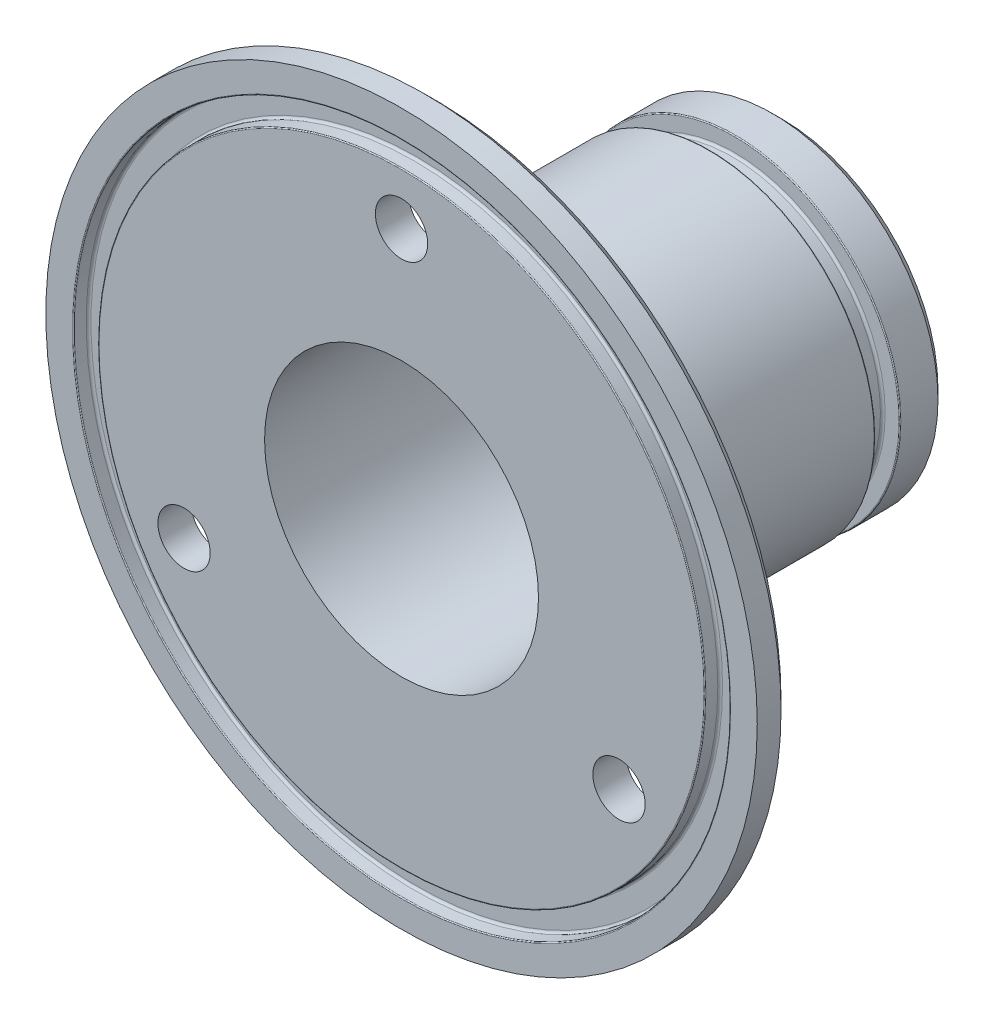
ISO-10303-21;
HEADER;
FILE_DESCRIPTION(('STEP AP214'),'2;1');
FILE_NAME('part.step','',(''),(''),'','','');
FILE_SCHEMA(('AUTOMOTIVE_DESIGN { 1 0 10303 214 1 1 1 1 }'));
ENDSEC;
DATA;
#1=APPLICATION_CONTEXT('core data for automotive mechanical design processes');
#2=APPLICATION_PROTOCOL_DEFINITION('international standard','automotive_design',2000,#1);
#3=PRODUCT_CONTEXT('',#1,'mechanical');
#4=PRODUCT('Part','Part','',(#3));
#5=PRODUCT_RELATED_PRODUCT_CATEGORY('part','',(#4));
#6=PRODUCT_DEFINITION_FORMATION('','',#4);
#7=PRODUCT_DEFINITION_CONTEXT('part definition',#1,'design');
#8=PRODUCT_DEFINITION('design','',#6,#7);
#9=PRODUCT_DEFINITION_SHAPE('','',#8);
#10=(LENGTH_UNIT() NAMED_UNIT(*) SI_UNIT(.MILLI.,.METRE.));
#11=(NAMED_UNIT(*) PLANE_ANGLE_UNIT() SI_UNIT($,.RADIAN.));
#12=(NAMED_UNIT(*) SI_UNIT($,.STERADIAN.) SOLID_ANGLE_UNIT());
#13=UNCERTAINTY_MEASURE_WITH_UNIT(LENGTH_MEASURE(1.E-05),#10,'distance_accuracy_value','');
#14=(GEOMETRIC_REPRESENTATION_CONTEXT(3) GLOBAL_UNCERTAINTY_ASSIGNED_CONTEXT((#13)) GLOBAL_UNIT_ASSIGNED_CONTEXT((#10,
#11,#12)) REPRESENTATION_CONTEXT('',''));
#15=CARTESIAN_POINT('',(0.,0.,0.));
#16=DIRECTION('',(0.,0.,1.));
#17=DIRECTION('',(1.,0.,0.));
#18=AXIS2_PLACEMENT_3D('',#15,#16,#17);
#19=CARTESIAN_POINT('',(0.,0.,40.));
#20=DIRECTION('',(0.,0.,1.));
#21=DIRECTION('',(1.,0.,0.));
#22=AXIS2_PLACEMENT_3D('',#19,#20,#21);
#23=PLANE('',#22);
#24=CARTESIAN_POINT('',(0.,0.,40.));
#25=DIRECTION('',(0.,0.,1.));
#26=DIRECTION('',(1.,0.,0.));
#27=AXIS2_PLACEMENT_3D('',#24,#25,#26);
#28=CIRCLE('',#27,31.8);
#29=CARTESIAN_POINT('',(31.8,0.,40.));
#30=VERTEX_POINT('',#29);
#31=EDGE_CURVE('E91',#30,#30,#28,.T.);
#32=ORIENTED_EDGE('',*,*,#31,.T.);
#33=EDGE_LOOP('',(#32));
#34=FACE_BOUND('',#33,.T.);
#35=CARTESIAN_POINT('',(0.,26.4,40.));
#36=DIRECTION('',(0.,0.,-1.));
#37=DIRECTION('',(-1.,0.,0.));
#38=AXIS2_PLACEMENT_3D('',#35,#36,#37);
#39=CIRCLE('',#38,2.75);
#40=CARTESIAN_POINT('',(-2.75,26.4,40.));
#41=VERTEX_POINT('',#40);
#42=EDGE_CURVE('E152',#41,#41,#39,.T.);
#43=ORIENTED_EDGE('',*,*,#42,.T.);
#44=EDGE_LOOP('',(#43));
#45=FACE_BOUND('',#44,.T.);
#46=CARTESIAN_POINT('',(22.8630706599093,-13.1999999999998,40.));
#47=DIRECTION('',(0.,0.,-1.));
#48=DIRECTION('',(0.499999999999992,0.866025403784443,0.));
#49=AXIS2_PLACEMENT_3D('',#46,#47,#48);
#50=CIRCLE('',#49,2.75);
#51=CARTESIAN_POINT('',(24.2380706599093,-10.8184301395926,40.));
#52=VERTEX_POINT('',#51);
#53=EDGE_CURVE('E166',#52,#52,#50,.T.);
#54=ORIENTED_EDGE('',*,*,#53,.T.);
#55=EDGE_LOOP('',(#54));
#56=FACE_BOUND('',#55,.T.);
#57=CARTESIAN_POINT('',(-22.8630706599091,-13.2000000000001,40.));
#58=DIRECTION('',(0.,0.,-1.));
#59=DIRECTION('',(0.500000000000004,-0.866025403784436,0.));
#60=AXIS2_PLACEMENT_3D('',#57,#58,#59);
#61=CIRCLE('',#60,2.75);
#62=CARTESIAN_POINT('',(-21.4880706599091,-15.5815698604073,40.));
#63=VERTEX_POINT('',#62);
#64=EDGE_CURVE('E165',#63,#63,#61,.T.);
#65=ORIENTED_EDGE('',*,*,#64,.T.);
#66=EDGE_LOOP('',(#65));
#67=FACE_BOUND('',#66,.T.);
#68=CARTESIAN_POINT('',(0.,0.,40.));
#69=DIRECTION('',(0.,0.,1.));
#70=DIRECTION('',(1.,0.,0.));
#71=AXIS2_PLACEMENT_3D('',#68,#69,#70);
#72=CIRCLE('',#71,14.4);
#73=CARTESIAN_POINT('',(14.4,0.,40.));
#74=VERTEX_POINT('',#73);
#75=EDGE_CURVE('E140',#74,#74,#72,.T.);
#76=ORIENTED_EDGE('',*,*,#75,.F.);
#77=EDGE_LOOP('',(#76));
#78=FACE_BOUND('',#77,.T.);
#79=ADVANCED_FACE('F42',(#34,#45,#56,#67,#78),#23,.T.);
#80=CARTESIAN_POINT('',(0.,0.,40.));
#81=DIRECTION('',(0.,0.,-1.));
#82=DIRECTION('',(-1.,0.,0.));
#83=AXIS2_PLACEMENT_3D('',#80,#81,#82);
#84=CYLINDRICAL_SURFACE('',#83,17.4);
#85=CARTESIAN_POINT('',(0.,0.,35.5));
#86=DIRECTION('',(0.,0.,1.));
#87=DIRECTION('',(1.,0.,0.));
#88=AXIS2_PLACEMENT_3D('',#85,#86,#87);
#89=CIRCLE('',#88,17.4);
#90=CARTESIAN_POINT('',(17.4,0.,35.5));
#91=VERTEX_POINT('',#90);
#92=EDGE_CURVE('E58',#91,#91,#89,.F.);
#93=ORIENTED_EDGE('',*,*,#92,.T.);
#94=EDGE_LOOP('',(#93));
#95=FACE_BOUND('',#94,.T.);
#96=CARTESIAN_POINT('',(0.,0.,7.7));
#97=DIRECTION('',(0.,0.,-1.));
#98=DIRECTION('',(-1.,0.,0.));
#99=AXIS2_PLACEMENT_3D('',#96,#97,#98);
#100=CIRCLE('',#99,17.4);
#101=CARTESIAN_POINT('',(-17.4,0.,7.7));
#102=VERTEX_POINT('',#101);
#103=EDGE_CURVE('E130',#102,#102,#100,.F.);
#104=ORIENTED_EDGE('',*,*,#103,.T.);
#105=EDGE_LOOP('',(#104));
#106=FACE_BOUND('',#105,.T.);
#107=ADVANCED_FACE('F207',(#95,#106),#84,.T.);
#108=CARTESIAN_POINT('',(0.,0.,1.00000000000002));
#109=DIRECTION('',(0.,0.,1.));
#110=DIRECTION('',(1.,0.,0.));
#111=AXIS2_PLACEMENT_3D('',#108,#109,#110);
#112=CIRCLE('',#111,17.4);
#113=CARTESIAN_POINT('',(17.4,0.,1.00000000000002));
#114=VERTEX_POINT('',#113);
#115=EDGE_CURVE('E51',#114,#114,#112,.T.);
#116=ORIENTED_EDGE('',*,*,#115,.T.);
#117=EDGE_LOOP('',(#116));
#118=FACE_BOUND('',#117,.T.);
#119=CARTESIAN_POINT('',(0.,0.,4.9));
#120=DIRECTION('',(0.,0.,1.));
#121=DIRECTION('',(1.,0.,0.));
#122=AXIS2_PLACEMENT_3D('',#119,#120,#121);
#123=CIRCLE('',#122,17.4);
#124=CARTESIAN_POINT('',(17.4,0.,4.9));
#125=VERTEX_POINT('',#124);
#126=EDGE_CURVE('E134',#125,#125,#123,.F.);
#127=ORIENTED_EDGE('',*,*,#126,.T.);
#128=EDGE_LOOP('',(#127));
#129=FACE_BOUND('',#128,.T.);
#130=ADVANCED_FACE('F215',(#118,#129),#84,.T.);
#131=CARTESIAN_POINT('',(0.,0.,40.));
#132=DIRECTION('',(0.,0.,1.));
#133=DIRECTION('',(1.,0.,0.));
#134=AXIS2_PLACEMENT_3D('',#131,#132,#133);
#135=CIRCLE('',#134,34.6);
#136=CARTESIAN_POINT('',(34.6,0.,40.));
#137=VERTEX_POINT('',#136);
#138=EDGE_CURVE('E79',#137,#137,#135,.F.);
#139=ORIENTED_EDGE('',*,*,#138,.T.);
#140=EDGE_LOOP('',(#139));
#141=FACE_BOUND('',#140,.T.);
#142=CARTESIAN_POINT('',(0.,0.,40.));
#143=DIRECTION('',(0.,0.,1.));
#144=DIRECTION('',(1.,0.,0.));
#145=AXIS2_PLACEMENT_3D('',#142,#143,#144);
#146=CIRCLE('',#145,37.4);
#147=CARTESIAN_POINT('',(37.4,0.,40.));
#148=VERTEX_POINT('',#147);
#149=EDGE_CURVE('E145',#148,#148,#146,.T.);
#150=ORIENTED_EDGE('',*,*,#149,.T.);
#151=EDGE_LOOP('',(#150));
#152=FACE_BOUND('',#151,.T.);
#153=ADVANCED_FACE('F210',(#141,#152),#23,.T.);
#154=CARTESIAN_POINT('',(0.,0.,0.));
#155=DIRECTION('',(0.,0.,1.));
#156=DIRECTION('',(1.,0.,0.));
#157=AXIS2_PLACEMENT_3D('',#154,#155,#156);
#158=PLANE('',#157);
#159=CARTESIAN_POINT('',(0.,0.,0.));
#160=DIRECTION('',(0.,0.,1.));
#161=DIRECTION('',(1.,0.,0.));
#162=AXIS2_PLACEMENT_3D('',#159,#160,#161);
#163=CIRCLE('',#162,16.4);
#164=CARTESIAN_POINT('',(16.4,0.,0.));
#165=VERTEX_POINT('',#164);
#166=EDGE_CURVE('E10',#165,#165,#163,.F.);
#167=ORIENTED_EDGE('',*,*,#166,.T.);
#168=EDGE_LOOP('',(#167));
#169=FACE_BOUND('',#168,.T.);
#170=CARTESIAN_POINT('',(0.,0.,0.));
#171=DIRECTION('',(0.,0.,1.));
#172=DIRECTION('',(1.,0.,0.));
#173=AXIS2_PLACEMENT_3D('',#170,#171,#172);
#174=CIRCLE('',#173,14.4);
#175=CARTESIAN_POINT('',(14.4,0.,0.));
#176=VERTEX_POINT('',#175);
#177=EDGE_CURVE('E141',#176,#176,#174,.T.);
#178=ORIENTED_EDGE('',*,*,#177,.T.);
#179=EDGE_LOOP('',(#178));
#180=FACE_BOUND('',#179,.T.);
#181=ADVANCED_FACE('F222',(#169,#180),#158,.F.);
#182=CARTESIAN_POINT('',(0.,0.,40.));
#183=DIRECTION('',(0.,0.,-1.));
#184=DIRECTION('',(-1.,0.,0.));
#185=AXIS2_PLACEMENT_3D('',#182,#183,#184);
#186=CYLINDRICAL_SURFACE('',#185,14.4);
#187=ORIENTED_EDGE('',*,*,#75,.T.);
#188=EDGE_LOOP('',(#187));
#189=FACE_BOUND('',#188,.T.);
#190=ORIENTED_EDGE('',*,*,#177,.F.);
#191=EDGE_LOOP('',(#190));
#192=FACE_BOUND('',#191,.T.);
#193=ADVANCED_FACE('F228',(#189,#192),#186,.F.);
#194=CARTESIAN_POINT('',(-17.4,0.,5.));
#195=DIRECTION('',(0.,0.,1.));
#196=DIRECTION('',(1.,0.,0.));
#197=AXIS2_PLACEMENT_3D('',#194,#195,#196);
#198=PLANE('',#197);
#199=CARTESIAN_POINT('',(0.,0.,5.));
#200=DIRECTION('',(0.,0.,1.));
#201=DIRECTION('',(1.,0.,0.));
#202=AXIS2_PLACEMENT_3D('',#199,#200,#201);
#203=CIRCLE('',#202,15.85);
#204=CARTESIAN_POINT('',(15.85,0.,5.));
#205=VERTEX_POINT('',#204);
#206=EDGE_CURVE('E115',#205,#205,#203,.F.);
#207=ORIENTED_EDGE('',*,*,#206,.T.);
#208=EDGE_LOOP('',(#207));
#209=FACE_BOUND('',#208,.T.);
#210=CARTESIAN_POINT('',(0.,0.,5.));
#211=DIRECTION('',(0.,0.,1.));
#212=DIRECTION('',(1.,0.,0.));
#213=AXIS2_PLACEMENT_3D('',#210,#211,#212);
#214=CIRCLE('',#213,17.3);
#215=CARTESIAN_POINT('',(17.3,0.,5.));
#216=VERTEX_POINT('',#215);
#217=EDGE_CURVE('E137',#216,#216,#214,.T.);
#218=ORIENTED_EDGE('',*,*,#217,.T.);
#219=EDGE_LOOP('',(#218));
#220=FACE_BOUND('',#219,.T.);
#221=ADVANCED_FACE('F252',(#209,#220),#198,.T.);
#222=CARTESIAN_POINT('',(0.,0.,40.));
#223=DIRECTION('',(0.,0.,1.));
#224=DIRECTION('',(1.,0.,0.));
#225=AXIS2_PLACEMENT_3D('',#222,#223,#224);
#226=CYLINDRICAL_SURFACE('',#225,15.6);
#227=CARTESIAN_POINT('',(0.,0.,5.25));
#228=DIRECTION('',(0.,0.,1.));
#229=DIRECTION('',(1.,0.,0.));
#230=AXIS2_PLACEMENT_3D('',#227,#228,#229);
#231=CIRCLE('',#230,15.6);
#232=CARTESIAN_POINT('',(15.6,0.,5.25));
#233=VERTEX_POINT('',#232);
#234=EDGE_CURVE('E118',#233,#233,#231,.T.);
#235=ORIENTED_EDGE('',*,*,#234,.T.);
#236=EDGE_LOOP('',(#235));
#237=FACE_BOUND('',#236,.T.);
#238=CARTESIAN_POINT('',(0.,0.,7.35));
#239=DIRECTION('',(0.,0.,-1.));
#240=DIRECTION('',(-1.,0.,0.));
#241=AXIS2_PLACEMENT_3D('',#238,#239,#240);
#242=CIRCLE('',#241,15.6);
#243=CARTESIAN_POINT('',(-15.6,0.,7.35));
#244=VERTEX_POINT('',#243);
#245=EDGE_CURVE('E122',#244,#244,#242,.T.);
#246=ORIENTED_EDGE('',*,*,#245,.T.);
#247=EDGE_LOOP('',(#246));
#248=FACE_BOUND('',#247,.T.);
#249=ADVANCED_FACE('F248',(#237,#248),#226,.T.);
#250=CARTESIAN_POINT('',(-15.6,0.,7.6));
#251=DIRECTION('',(0.,0.,-1.));
#252=DIRECTION('',(-1.,0.,0.));
#253=AXIS2_PLACEMENT_3D('',#250,#251,#252);
#254=PLANE('',#253);
#255=CARTESIAN_POINT('',(0.,0.,7.6));
#256=DIRECTION('',(0.,0.,-1.));
#257=DIRECTION('',(-1.,0.,0.));
#258=AXIS2_PLACEMENT_3D('',#255,#256,#257);
#259=CIRCLE('',#258,15.85);
#260=CARTESIAN_POINT('',(-15.85,0.,7.6));
#261=VERTEX_POINT('',#260);
#262=EDGE_CURVE('E111',#261,#261,#259,.F.);
#263=ORIENTED_EDGE('',*,*,#262,.T.);
#264=EDGE_LOOP('',(#263));
#265=FACE_BOUND('',#264,.T.);
#266=CARTESIAN_POINT('',(0.,0.,7.6));
#267=DIRECTION('',(0.,0.,-1.));
#268=DIRECTION('',(-1.,0.,0.));
#269=AXIS2_PLACEMENT_3D('',#266,#267,#268);
#270=CIRCLE('',#269,17.3);
#271=CARTESIAN_POINT('',(-17.3,0.,7.6));
#272=VERTEX_POINT('',#271);
#273=EDGE_CURVE('E126',#272,#272,#270,.T.);
#274=ORIENTED_EDGE('',*,*,#273,.T.);
#275=EDGE_LOOP('',(#274));
#276=FACE_BOUND('',#275,.T.);
#277=ADVANCED_FACE('F244',(#265,#276),#254,.T.);
#278=CARTESIAN_POINT('',(0.,0.,4.9));
#279=DIRECTION('',(0.,0.,1.));
#280=DIRECTION('',(1.,0.,0.));
#281=AXIS2_PLACEMENT_3D('',#278,#279,#280);
#282=TOROIDAL_SURFACE('',#281,17.3,0.1);
#283=ORIENTED_EDGE('',*,*,#126,.F.);
#284=EDGE_LOOP('',(#283));
#285=FACE_BOUND('',#284,.T.);
#286=ORIENTED_EDGE('',*,*,#217,.F.);
#287=EDGE_LOOP('',(#286));
#288=FACE_BOUND('',#287,.T.);
#289=ADVANCED_FACE('F247',(#285,#288),#282,.T.);
#290=CARTESIAN_POINT('',(0.,0.,7.7));
#291=DIRECTION('',(0.,0.,-1.));
#292=DIRECTION('',(-1.,0.,0.));
#293=AXIS2_PLACEMENT_3D('',#290,#291,#292);
#294=TOROIDAL_SURFACE('',#293,17.3,0.1);
#295=ORIENTED_EDGE('',*,*,#273,.F.);
#296=EDGE_LOOP('',(#295));
#297=FACE_BOUND('',#296,.T.);
#298=ORIENTED_EDGE('',*,*,#103,.F.);
#299=EDGE_LOOP('',(#298));
#300=FACE_BOUND('',#299,.T.);
#301=ADVANCED_FACE('F431',(#297,#300),#294,.T.);
#302=CARTESIAN_POINT('',(0.,0.,5.25));
#303=DIRECTION('',(0.,0.,1.));
#304=DIRECTION('',(1.,0.,0.));
#305=AXIS2_PLACEMENT_3D('',#302,#303,#304);
#306=TOROIDAL_SURFACE('',#305,15.85,0.25);
#307=ORIENTED_EDGE('',*,*,#206,.F.);
#308=EDGE_LOOP('',(#307));
#309=FACE_BOUND('',#308,.T.);
#310=ORIENTED_EDGE('',*,*,#234,.F.);
#311=EDGE_LOOP('',(#310));
#312=FACE_BOUND('',#311,.T.);
#313=ADVANCED_FACE('F240',(#309,#312),#306,.F.);
#314=CARTESIAN_POINT('',(0.,0.,7.35));
#315=DIRECTION('',(0.,0.,-1.));
#316=DIRECTION('',(-1.,0.,0.));
#317=AXIS2_PLACEMENT_3D('',#314,#315,#316);
#318=TOROIDAL_SURFACE('',#317,15.85,0.25);
#319=ORIENTED_EDGE('',*,*,#245,.F.);
#320=EDGE_LOOP('',(#319));
#321=FACE_BOUND('',#320,.T.);
#322=ORIENTED_EDGE('',*,*,#262,.F.);
#323=EDGE_LOOP('',(#322));
#324=FACE_BOUND('',#323,.T.);
#325=ADVANCED_FACE('F234',(#321,#324),#318,.F.);
#326=CARTESIAN_POINT('',(0.,0.,36.5));
#327=DIRECTION('',(0.,0.,1.));
#328=DIRECTION('',(1.,0.,0.));
#329=AXIS2_PLACEMENT_3D('',#326,#327,#328);
#330=CYLINDRICAL_SURFACE('',#329,37.4);
#331=CARTESIAN_POINT('',(0.,0.,37.5));
#332=DIRECTION('',(0.,0.,1.));
#333=DIRECTION('',(1.,0.,0.));
#334=AXIS2_PLACEMENT_3D('',#331,#332,#333);
#335=CIRCLE('',#334,37.4);
#336=CARTESIAN_POINT('',(37.4,0.,37.5));
#337=VERTEX_POINT('',#336);
#338=EDGE_CURVE('E75',#337,#337,#335,.T.);
#339=ORIENTED_EDGE('',*,*,#338,.T.);
#340=EDGE_LOOP('',(#339));
#341=FACE_BOUND('',#340,.T.);
#342=ORIENTED_EDGE('',*,*,#149,.F.);
#343=EDGE_LOOP('',(#342));
#344=FACE_BOUND('',#343,.T.);
#345=ADVANCED_FACE('F190',(#341,#344),#330,.T.);
#346=CARTESIAN_POINT('',(0.,0.,36.5));
#347=DIRECTION('',(0.,0.,1.));
#348=DIRECTION('',(1.,0.,0.));
#349=AXIS2_PLACEMENT_3D('',#346,#347,#348);
#350=PLANE('',#349);
#351=CARTESIAN_POINT('',(0.,0.,36.5));
#352=DIRECTION('',(0.,0.,1.));
#353=DIRECTION('',(1.,0.,0.));
#354=AXIS2_PLACEMENT_3D('',#351,#352,#353);
#355=CIRCLE('',#354,18.4);
#356=CARTESIAN_POINT('',(18.4,0.,36.5));
#357=VERTEX_POINT('',#356);
#358=EDGE_CURVE('E65',#357,#357,#355,.T.);
#359=ORIENTED_EDGE('',*,*,#358,.T.);
#360=EDGE_LOOP('',(#359));
#361=FACE_BOUND('',#360,.T.);
#362=CARTESIAN_POINT('',(0.,0.,36.5));
#363=DIRECTION('',(0.,0.,1.));
#364=DIRECTION('',(1.,0.,0.));
#365=AXIS2_PLACEMENT_3D('',#362,#363,#364);
#366=CIRCLE('',#365,36.4);
#367=CARTESIAN_POINT('',(36.4,0.,36.5));
#368=VERTEX_POINT('',#367);
#369=EDGE_CURVE('E71',#368,#368,#366,.F.);
#370=ORIENTED_EDGE('',*,*,#369,.T.);
#371=EDGE_LOOP('',(#370));
#372=FACE_BOUND('',#371,.T.);
#373=CARTESIAN_POINT('',(-22.8630706599091,-13.2000000000001,36.5));
#374=DIRECTION('',(0.,0.,-1.));
#375=DIRECTION('',(0.500000000000004,-0.866025403784436,0.));
#376=AXIS2_PLACEMENT_3D('',#373,#374,#375);
#377=CIRCLE('',#376,2.74999999999999);
#378=CARTESIAN_POINT('',(-21.4880706599091,-15.5815698604073,36.5));
#379=VERTEX_POINT('',#378);
#380=EDGE_CURVE('E160',#379,#379,#377,.T.);
#381=ORIENTED_EDGE('',*,*,#380,.F.);
#382=EDGE_LOOP('',(#381));
#383=FACE_BOUND('',#382,.T.);
#384=CARTESIAN_POINT('',(22.8630706599093,-13.1999999999998,36.5));
#385=DIRECTION('',(0.,0.,-1.));
#386=DIRECTION('',(0.499999999999992,0.866025403784443,0.));
#387=AXIS2_PLACEMENT_3D('',#384,#385,#386);
#388=CIRCLE('',#387,2.74999999999999);
#389=CARTESIAN_POINT('',(24.2380706599093,-10.8184301395926,36.5));
#390=VERTEX_POINT('',#389);
#391=EDGE_CURVE('E161',#390,#390,#388,.T.);
#392=ORIENTED_EDGE('',*,*,#391,.F.);
#393=EDGE_LOOP('',(#392));
#394=FACE_BOUND('',#393,.T.);
#395=CARTESIAN_POINT('',(0.,26.4,36.5));
#396=DIRECTION('',(0.,0.,-1.));
#397=DIRECTION('',(-1.,0.,0.));
#398=AXIS2_PLACEMENT_3D('',#395,#396,#397);
#399=CIRCLE('',#398,2.74999999999999);
#400=CARTESIAN_POINT('',(-2.74999999999999,26.4,36.5));
#401=VERTEX_POINT('',#400);
#402=EDGE_CURVE('E156',#401,#401,#399,.T.);
#403=ORIENTED_EDGE('',*,*,#402,.F.);
#404=EDGE_LOOP('',(#403));
#405=FACE_BOUND('',#404,.T.);
#406=ADVANCED_FACE('F186',(#361,#372,#383,#394,#405),#350,.F.);
#407=CARTESIAN_POINT('',(0.,26.4,36.5));
#408=DIRECTION('',(0.,0.,-1.));
#409=DIRECTION('',(-1.,0.,0.));
#410=AXIS2_PLACEMENT_3D('',#407,#408,#409);
#411=CYLINDRICAL_SURFACE('',#410,2.74999999999999);
#412=ORIENTED_EDGE('',*,*,#42,.F.);
#413=EDGE_LOOP('',(#412));
#414=FACE_BOUND('',#413,.T.);
#415=ORIENTED_EDGE('',*,*,#402,.T.);
#416=EDGE_LOOP('',(#415));
#417=FACE_BOUND('',#416,.T.);
#418=ADVANCED_FACE('F189',(#414,#417),#411,.F.);
#419=CARTESIAN_POINT('',(22.8630706599093,-13.1999999999998,36.5));
#420=DIRECTION('',(0.,0.,-1.));
#421=DIRECTION('',(0.499999999999992,0.866025403784443,0.));
#422=AXIS2_PLACEMENT_3D('',#419,#420,#421);
#423=CYLINDRICAL_SURFACE('',#422,2.74999999999999);
#424=ORIENTED_EDGE('',*,*,#53,.F.);
#425=EDGE_LOOP('',(#424));
#426=FACE_BOUND('',#425,.T.);
#427=ORIENTED_EDGE('',*,*,#391,.T.);
#428=EDGE_LOOP('',(#427));
#429=FACE_BOUND('',#428,.T.);
#430=ADVANCED_FACE('F182',(#426,#429),#423,.F.);
#431=CARTESIAN_POINT('',(-22.8630706599091,-13.2000000000001,36.5));
#432=DIRECTION('',(0.,0.,-1.));
#433=DIRECTION('',(0.500000000000004,-0.866025403784436,0.));
#434=AXIS2_PLACEMENT_3D('',#431,#432,#433);
#435=CYLINDRICAL_SURFACE('',#434,2.74999999999999);
#436=ORIENTED_EDGE('',*,*,#64,.F.);
#437=EDGE_LOOP('',(#436));
#438=FACE_BOUND('',#437,.T.);
#439=ORIENTED_EDGE('',*,*,#380,.T.);
#440=EDGE_LOOP('',(#439));
#441=FACE_BOUND('',#440,.T.);
#442=ADVANCED_FACE('F178',(#438,#441),#435,.F.);
#443=CARTESIAN_POINT('',(0.,0.,38.4));
#444=DIRECTION('',(0.,0.,1.));
#445=DIRECTION('',(1.,0.,0.));
#446=AXIS2_PLACEMENT_3D('',#443,#444,#445);
#447=CYLINDRICAL_SURFACE('',#446,34.5);
#448=CARTESIAN_POINT('',(0.,0.,39.9));
#449=DIRECTION('',(0.,0.,1.));
#450=DIRECTION('',(1.,0.,0.));
#451=AXIS2_PLACEMENT_3D('',#448,#449,#450);
#452=CIRCLE('',#451,34.5);
#453=CARTESIAN_POINT('',(34.5,0.,39.9));
#454=VERTEX_POINT('',#453);
#455=EDGE_CURVE('E83',#454,#454,#452,.T.);
#456=ORIENTED_EDGE('',*,*,#455,.T.);
#457=EDGE_LOOP('',(#456));
#458=FACE_BOUND('',#457,.T.);
#459=CARTESIAN_POINT('',(0.,0.,38.65));
#460=DIRECTION('',(0.,0.,1.));
#461=DIRECTION('',(1.,0.,0.));
#462=AXIS2_PLACEMENT_3D('',#459,#460,#461);
#463=CIRCLE('',#462,34.5);
#464=CARTESIAN_POINT('',(34.5,0.,38.65));
#465=VERTEX_POINT('',#464);
#466=EDGE_CURVE('E95',#465,#465,#463,.F.);
#467=ORIENTED_EDGE('',*,*,#466,.T.);
#468=EDGE_LOOP('',(#467));
#469=FACE_BOUND('',#468,.T.);
#470=ADVANCED_FACE('F181',(#458,#469),#447,.F.);
#471=CARTESIAN_POINT('',(0.,0.,38.4));
#472=DIRECTION('',(0.,0.,1.));
#473=DIRECTION('',(1.,0.,0.));
#474=AXIS2_PLACEMENT_3D('',#471,#472,#473);
#475=PLANE('',#474);
#476=CARTESIAN_POINT('',(0.,0.,38.4));
#477=DIRECTION('',(0.,0.,1.));
#478=DIRECTION('',(1.,0.,0.));
#479=AXIS2_PLACEMENT_3D('',#476,#477,#478);
#480=CIRCLE('',#479,32.15);
#481=CARTESIAN_POINT('',(32.15,0.,38.4));
#482=VERTEX_POINT('',#481);
#483=EDGE_CURVE('E99',#482,#482,#480,.F.);
#484=ORIENTED_EDGE('',*,*,#483,.T.);
#485=EDGE_LOOP('',(#484));
#486=FACE_BOUND('',#485,.T.);
#487=CARTESIAN_POINT('',(0.,0.,38.4));
#488=DIRECTION('',(0.,0.,1.));
#489=DIRECTION('',(1.,0.,0.));
#490=AXIS2_PLACEMENT_3D('',#487,#488,#489);
#491=CIRCLE('',#490,34.25);
#492=CARTESIAN_POINT('',(34.25,0.,38.4));
#493=VERTEX_POINT('',#492);
#494=EDGE_CURVE('E103',#493,#493,#491,.T.);
#495=ORIENTED_EDGE('',*,*,#494,.T.);
#496=EDGE_LOOP('',(#495));
#497=FACE_BOUND('',#496,.T.);
#498=ADVANCED_FACE('F347',(#486,#497),#475,.T.);
#499=CARTESIAN_POINT('',(0.,0.,38.4));
#500=DIRECTION('',(0.,0.,1.));
#501=DIRECTION('',(1.,0.,0.));
#502=AXIS2_PLACEMENT_3D('',#499,#500,#501);
#503=CYLINDRICAL_SURFACE('',#502,31.9);
#504=CARTESIAN_POINT('',(0.,0.,39.9));
#505=DIRECTION('',(0.,0.,1.));
#506=DIRECTION('',(1.,0.,0.));
#507=AXIS2_PLACEMENT_3D('',#504,#505,#506);
#508=CIRCLE('',#507,31.9);
#509=CARTESIAN_POINT('',(31.9,0.,39.9));
#510=VERTEX_POINT('',#509);
#511=EDGE_CURVE('E87',#510,#510,#508,.F.);
#512=ORIENTED_EDGE('',*,*,#511,.T.);
#513=EDGE_LOOP('',(#512));
#514=FACE_BOUND('',#513,.T.);
#515=CARTESIAN_POINT('',(0.,0.,38.65));
#516=DIRECTION('',(0.,0.,1.));
#517=DIRECTION('',(1.,0.,0.));
#518=AXIS2_PLACEMENT_3D('',#515,#516,#517);
#519=CIRCLE('',#518,31.9);
#520=CARTESIAN_POINT('',(31.9,0.,38.65));
#521=VERTEX_POINT('',#520);
#522=EDGE_CURVE('E107',#521,#521,#519,.T.);
#523=ORIENTED_EDGE('',*,*,#522,.T.);
#524=EDGE_LOOP('',(#523));
#525=FACE_BOUND('',#524,.T.);
#526=ADVANCED_FACE('F339',(#514,#525),#503,.T.);
#527=CARTESIAN_POINT('',(0.,0.,38.65));
#528=DIRECTION('',(0.,0.,1.));
#529=DIRECTION('',(1.,0.,0.));
#530=AXIS2_PLACEMENT_3D('',#527,#528,#529);
#531=TOROIDAL_SURFACE('',#530,32.15,0.25);
#532=ORIENTED_EDGE('',*,*,#483,.F.);
#533=EDGE_LOOP('',(#532));
#534=FACE_BOUND('',#533,.T.);
#535=ORIENTED_EDGE('',*,*,#522,.F.);
#536=EDGE_LOOP('',(#535));
#537=FACE_BOUND('',#536,.T.);
#538=ADVANCED_FACE('F331',(#534,#537),#531,.F.);
#539=CARTESIAN_POINT('',(0.,0.,38.65));
#540=DIRECTION('',(0.,0.,1.));
#541=DIRECTION('',(1.,0.,0.));
#542=AXIS2_PLACEMENT_3D('',#539,#540,#541);
#543=TOROIDAL_SURFACE('',#542,34.25,0.25);
#544=ORIENTED_EDGE('',*,*,#466,.F.);
#545=EDGE_LOOP('',(#544));
#546=FACE_BOUND('',#545,.T.);
#547=ORIENTED_EDGE('',*,*,#494,.F.);
#548=EDGE_LOOP('',(#547));
#549=FACE_BOUND('',#548,.T.);
#550=ADVANCED_FACE('F322',(#546,#549),#543,.F.);
#551=CARTESIAN_POINT('',(0.,0.,39.9));
#552=DIRECTION('',(0.,0.,1.));
#553=DIRECTION('',(1.,0.,0.));
#554=AXIS2_PLACEMENT_3D('',#551,#552,#553);
#555=TOROIDAL_SURFACE('',#554,31.8,0.1);
#556=ORIENTED_EDGE('',*,*,#511,.F.);
#557=EDGE_LOOP('',(#556));
#558=FACE_BOUND('',#557,.T.);
#559=ORIENTED_EDGE('',*,*,#31,.F.);
#560=EDGE_LOOP('',(#559));
#561=FACE_BOUND('',#560,.T.);
#562=ADVANCED_FACE('F314',(#558,#561),#555,.T.);
#563=CARTESIAN_POINT('',(0.,0.,39.9));
#564=DIRECTION('',(0.,0.,1.));
#565=DIRECTION('',(1.,0.,0.));
#566=AXIS2_PLACEMENT_3D('',#563,#564,#565);
#567=TOROIDAL_SURFACE('',#566,34.6,0.1);
#568=ORIENTED_EDGE('',*,*,#138,.F.);
#569=EDGE_LOOP('',(#568));
#570=FACE_BOUND('',#569,.T.);
#571=ORIENTED_EDGE('',*,*,#455,.F.);
#572=EDGE_LOOP('',(#571));
#573=FACE_BOUND('',#572,.T.);
#574=ADVANCED_FACE('F306',(#570,#573),#567,.T.);
#575=CARTESIAN_POINT('',(0.,0.,37.5));
#576=DIRECTION('',(0.,0.,1.));
#577=DIRECTION('',(1.,0.,0.));
#578=AXIS2_PLACEMENT_3D('',#575,#576,#577);
#579=CONICAL_SURFACE('',#578,37.4,0.785398163397452);
#580=ORIENTED_EDGE('',*,*,#369,.F.);
#581=EDGE_LOOP('',(#580));
#582=FACE_BOUND('',#581,.T.);
#583=ORIENTED_EDGE('',*,*,#338,.F.);
#584=EDGE_LOOP('',(#583));
#585=FACE_BOUND('',#584,.T.);
#586=ADVANCED_FACE('F302',(#582,#585),#579,.T.);
#587=CARTESIAN_POINT('',(0.,0.,35.5));
#588=DIRECTION('',(0.,0.,1.));
#589=DIRECTION('',(1.,0.,0.));
#590=AXIS2_PLACEMENT_3D('',#587,#588,#589);
#591=TOROIDAL_SURFACE('',#590,18.4,1.);
#592=ORIENTED_EDGE('',*,*,#92,.F.);
#593=EDGE_LOOP('',(#592));
#594=FACE_BOUND('',#593,.T.);
#595=ORIENTED_EDGE('',*,*,#358,.F.);
#596=EDGE_LOOP('',(#595));
#597=FACE_BOUND('',#596,.T.);
#598=ADVANCED_FACE('F283',(#594,#597),#591,.F.);
#599=CARTESIAN_POINT('',(0.,0.,1.00000000000002));
#600=DIRECTION('',(0.,0.,1.));
#601=DIRECTION('',(1.,0.,0.));
#602=AXIS2_PLACEMENT_3D('',#599,#600,#601);
#603=CONICAL_SURFACE('',#602,17.4,0.785398163397445);
#604=ORIENTED_EDGE('',*,*,#166,.F.);
#605=EDGE_LOOP('',(#604));
#606=FACE_BOUND('',#605,.T.);
#607=ORIENTED_EDGE('',*,*,#115,.F.);
#608=EDGE_LOOP('',(#607));
#609=FACE_BOUND('',#608,.T.);
#610=ADVANCED_FACE('F45',(#606,#609),#603,.T.);
#611=CLOSED_SHELL('',(#79,#107,#130,#153,#181,#193,#221,#249,#277,#289,#301,#313,#325,#345,#406,
#418,#430,#442,#470,#498,#526,#538,#550,#562,#574,#586,#598,#610));
#612=MANIFOLD_SOLID_BREP('B2',#611);
#613=ADVANCED_BREP_SHAPE_REPRESENTATION('',(#18,#612),#14);
#614=SHAPE_DEFINITION_REPRESENTATION(#9,#613);
ENDSEC;
END-ISO-10303-21;
